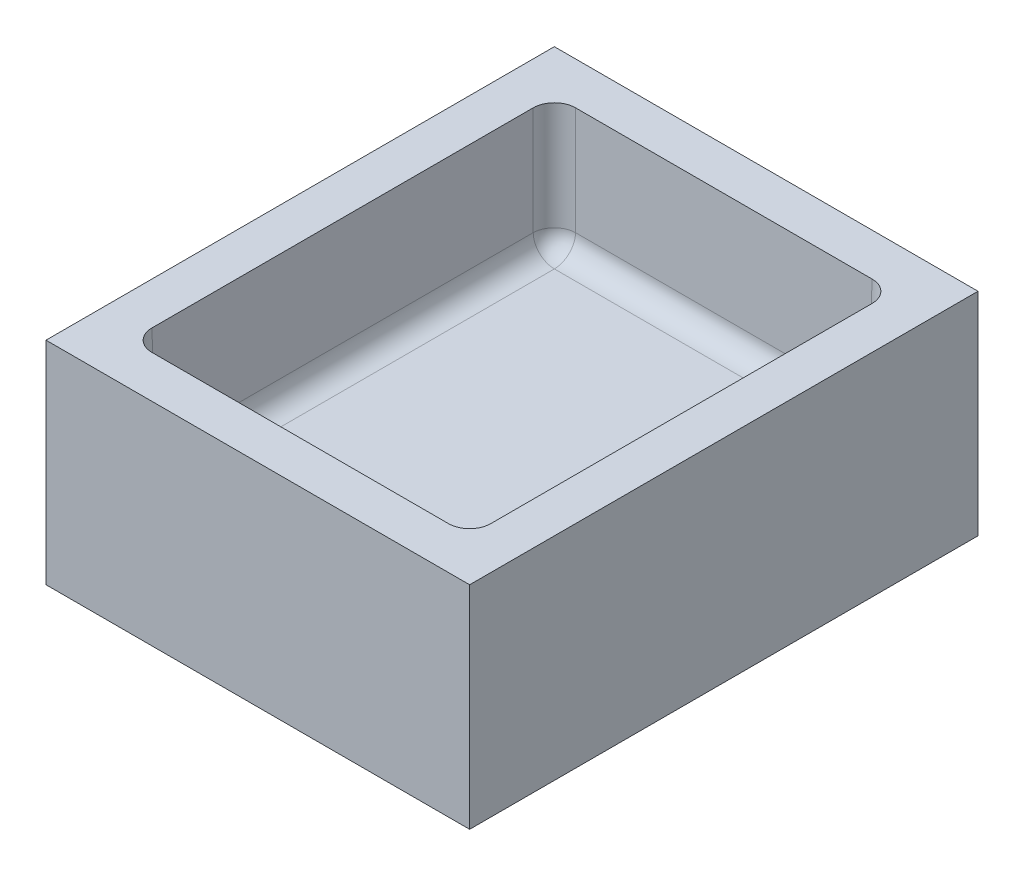
ISO-10303-21;
HEADER;
FILE_DESCRIPTION(('STEP AP214'),'2;1');
FILE_NAME('part.step','',(''),(''),'','','');
FILE_SCHEMA(('AUTOMOTIVE_DESIGN { 1 0 10303 214 1 1 1 1 }'));
ENDSEC;
DATA;
#1=APPLICATION_CONTEXT('core data for automotive mechanical design processes');
#2=APPLICATION_PROTOCOL_DEFINITION('international standard','automotive_design',2000,#1);
#3=PRODUCT_CONTEXT('',#1,'mechanical');
#4=PRODUCT('Part','Part','',(#3));
#5=PRODUCT_RELATED_PRODUCT_CATEGORY('part','',(#4));
#6=PRODUCT_DEFINITION_FORMATION('','',#4);
#7=PRODUCT_DEFINITION_CONTEXT('part definition',#1,'design');
#8=PRODUCT_DEFINITION('design','',#6,#7);
#9=PRODUCT_DEFINITION_SHAPE('','',#8);
#10=(LENGTH_UNIT() NAMED_UNIT(*) SI_UNIT(.MILLI.,.METRE.));
#11=(NAMED_UNIT(*) PLANE_ANGLE_UNIT() SI_UNIT($,.RADIAN.));
#12=(NAMED_UNIT(*) SI_UNIT($,.STERADIAN.) SOLID_ANGLE_UNIT());
#13=UNCERTAINTY_MEASURE_WITH_UNIT(LENGTH_MEASURE(1.E-05),#10,'distance_accuracy_value','');
#14=(GEOMETRIC_REPRESENTATION_CONTEXT(3) GLOBAL_UNCERTAINTY_ASSIGNED_CONTEXT((#13)) GLOBAL_UNIT_ASSIGNED_CONTEXT((#10,
#11,#12)) REPRESENTATION_CONTEXT('',''));
#15=CARTESIAN_POINT('',(0.,0.,0.));
#16=DIRECTION('',(0.,0.,1.));
#17=DIRECTION('',(1.,0.,0.));
#18=AXIS2_PLACEMENT_3D('',#15,#16,#17);
#19=CARTESIAN_POINT('',(-50.,-57.8548057287178,60.));
#20=DIRECTION('',(-1.,0.,0.));
#21=DIRECTION('',(0.,0.,1.));
#22=AXIS2_PLACEMENT_3D('',#19,#20,#21);
#23=PLANE('',#22);
#24=DIRECTION('',(0.,0.,1.));
#25=VECTOR('',#24,1.);
#26=CARTESIAN_POINT('',(-50.,-77.8548057287178,60.));
#27=LINE('',#26,#25);
#28=CARTESIAN_POINT('',(-50.,-77.8548057287178,-60.));
#29=VERTEX_POINT('',#28);
#30=CARTESIAN_POINT('',(-50.,-77.8548057287178,60.));
#31=VERTEX_POINT('',#30);
#32=EDGE_CURVE('E221',#29,#31,#27,.T.);
#33=ORIENTED_EDGE('',*,*,#32,.F.);
#34=DIRECTION('',(0.,-1.,0.));
#35=VECTOR('',#34,1.);
#36=CARTESIAN_POINT('',(-50.,-57.8548057287178,-60.));
#37=LINE('',#36,#35);
#38=CARTESIAN_POINT('',(-50.,-127.854805728718,-60.));
#39=VERTEX_POINT('',#38);
#40=EDGE_CURVE('E236',#29,#39,#37,.T.);
#41=ORIENTED_EDGE('',*,*,#40,.T.);
#42=DIRECTION('',(0.,0.,-1.));
#43=VECTOR('',#42,1.);
#44=CARTESIAN_POINT('',(-50.,-127.854805728718,60.));
#45=LINE('',#44,#43);
#46=CARTESIAN_POINT('',(-50.,-127.854805728718,60.));
#47=VERTEX_POINT('',#46);
#48=EDGE_CURVE('E224',#47,#39,#45,.T.);
#49=ORIENTED_EDGE('',*,*,#48,.F.);
#50=DIRECTION('',(0.,-1.,0.));
#51=VECTOR('',#50,1.);
#52=CARTESIAN_POINT('',(-50.,-57.8548057287178,60.));
#53=LINE('',#52,#51);
#54=EDGE_CURVE('E218',#31,#47,#53,.T.);
#55=ORIENTED_EDGE('',*,*,#54,.F.);
#56=EDGE_LOOP('',(#33,#41,#49,#55));
#57=FACE_BOUND('',#56,.T.);
#58=ADVANCED_FACE('F39',(#57),#23,.T.);
#59=CARTESIAN_POINT('',(-50.,-57.8548057287178,60.));
#60=DIRECTION('',(0.,0.,1.));
#61=DIRECTION('',(1.,0.,0.));
#62=AXIS2_PLACEMENT_3D('',#59,#60,#61);
#63=PLANE('',#62);
#64=DIRECTION('',(1.,0.,0.));
#65=VECTOR('',#64,1.);
#66=CARTESIAN_POINT('',(-50.,-77.8548057287178,60.));
#67=LINE('',#66,#65);
#68=CARTESIAN_POINT('',(50.,-77.8548057287178,60.));
#69=VERTEX_POINT('',#68);
#70=EDGE_CURVE('E217',#31,#69,#67,.T.);
#71=ORIENTED_EDGE('',*,*,#70,.F.);
#72=ORIENTED_EDGE('',*,*,#54,.T.);
#73=DIRECTION('',(-1.,0.,0.));
#74=VECTOR('',#73,1.);
#75=CARTESIAN_POINT('',(-50.,-127.854805728718,60.));
#76=LINE('',#75,#74);
#77=CARTESIAN_POINT('',(50.,-127.854805728718,60.));
#78=VERTEX_POINT('',#77);
#79=EDGE_CURVE('E233',#78,#47,#76,.T.);
#80=ORIENTED_EDGE('',*,*,#79,.F.);
#81=DIRECTION('',(0.,-1.,0.));
#82=VECTOR('',#81,1.);
#83=CARTESIAN_POINT('',(50.,-57.8548057287178,60.));
#84=LINE('',#83,#82);
#85=EDGE_CURVE('E239',#69,#78,#84,.T.);
#86=ORIENTED_EDGE('',*,*,#85,.F.);
#87=EDGE_LOOP('',(#71,#72,#80,#86));
#88=FACE_BOUND('',#87,.T.);
#89=ADVANCED_FACE('F270',(#88),#63,.T.);
#90=CARTESIAN_POINT('',(50.,-57.8548057287178,60.));
#91=DIRECTION('',(1.,0.,0.));
#92=DIRECTION('',(0.,0.,-1.));
#93=AXIS2_PLACEMENT_3D('',#90,#91,#92);
#94=PLANE('',#93);
#95=DIRECTION('',(0.,0.,-1.));
#96=VECTOR('',#95,1.);
#97=CARTESIAN_POINT('',(50.,-77.8548057287178,60.));
#98=LINE('',#97,#96);
#99=CARTESIAN_POINT('',(50.,-77.8548057287178,-60.));
#100=VERTEX_POINT('',#99);
#101=EDGE_CURVE('E214',#69,#100,#98,.T.);
#102=ORIENTED_EDGE('',*,*,#101,.F.);
#103=ORIENTED_EDGE('',*,*,#85,.T.);
#104=DIRECTION('',(0.,0.,1.));
#105=VECTOR('',#104,1.);
#106=CARTESIAN_POINT('',(50.,-127.854805728718,60.));
#107=LINE('',#106,#105);
#108=CARTESIAN_POINT('',(50.,-127.854805728718,-60.));
#109=VERTEX_POINT('',#108);
#110=EDGE_CURVE('E230',#109,#78,#107,.T.);
#111=ORIENTED_EDGE('',*,*,#110,.F.);
#112=DIRECTION('',(0.,-1.,0.));
#113=VECTOR('',#112,1.);
#114=CARTESIAN_POINT('',(50.,-57.8548057287178,-60.));
#115=LINE('',#114,#113);
#116=EDGE_CURVE('E242',#100,#109,#115,.T.);
#117=ORIENTED_EDGE('',*,*,#116,.F.);
#118=EDGE_LOOP('',(#102,#103,#111,#117));
#119=FACE_BOUND('',#118,.T.);
#120=ADVANCED_FACE('F283',(#119),#94,.T.);
#121=CARTESIAN_POINT('',(-50.,-57.8548057287178,-60.));
#122=DIRECTION('',(0.,0.,-1.));
#123=DIRECTION('',(-1.,0.,0.));
#124=AXIS2_PLACEMENT_3D('',#121,#122,#123);
#125=PLANE('',#124);
#126=DIRECTION('',(-1.,0.,0.));
#127=VECTOR('',#126,1.);
#128=CARTESIAN_POINT('',(-50.,-77.8548057287178,-60.));
#129=LINE('',#128,#127);
#130=EDGE_CURVE('E42',#100,#29,#129,.T.);
#131=ORIENTED_EDGE('',*,*,#130,.F.);
#132=ORIENTED_EDGE('',*,*,#116,.T.);
#133=DIRECTION('',(1.,0.,0.));
#134=VECTOR('',#133,1.);
#135=CARTESIAN_POINT('',(-50.,-127.854805728718,-60.));
#136=LINE('',#135,#134);
#137=EDGE_CURVE('E227',#39,#109,#136,.T.);
#138=ORIENTED_EDGE('',*,*,#137,.F.);
#139=ORIENTED_EDGE('',*,*,#40,.F.);
#140=EDGE_LOOP('',(#131,#132,#138,#139));
#141=FACE_BOUND('',#140,.T.);
#142=ADVANCED_FACE('F258',(#141),#125,.T.);
#143=CARTESIAN_POINT('',(0.,-127.854805728718,0.));
#144=DIRECTION('',(0.,-1.,0.));
#145=DIRECTION('',(0.,0.,-1.));
#146=AXIS2_PLACEMENT_3D('',#143,#144,#145);
#147=PLANE('',#146);
#148=ORIENTED_EDGE('',*,*,#48,.T.);
#149=ORIENTED_EDGE('',*,*,#137,.T.);
#150=ORIENTED_EDGE('',*,*,#110,.T.);
#151=ORIENTED_EDGE('',*,*,#79,.T.);
#152=EDGE_LOOP('',(#148,#149,#150,#151));
#153=FACE_BOUND('',#152,.T.);
#154=ADVANCED_FACE('F262',(#153),#147,.T.);
#155=CARTESIAN_POINT('',(0.,-107.854805728718,0.));
#156=DIRECTION('',(0.,-1.,0.));
#157=DIRECTION('',(0.,0.,-1.));
#158=AXIS2_PLACEMENT_3D('',#155,#156,#157);
#159=PLANE('',#158);
#160=DIRECTION('',(1.,0.,0.));
#161=VECTOR('',#160,1.);
#162=CARTESIAN_POINT('',(0.,-107.854805728718,44.562861736575));
#163=LINE('',#162,#161);
#164=CARTESIAN_POINT('',(34.562861736575,-107.854805728718,44.562861736575));
#165=VERTEX_POINT('',#164);
#166=CARTESIAN_POINT('',(-34.562861736575,-107.854805728718,44.562861736575));
#167=VERTEX_POINT('',#166);
#168=EDGE_CURVE('E166',#165,#167,#163,.F.);
#169=ORIENTED_EDGE('',*,*,#168,.F.);
#170=DIRECTION('',(0.,0.,-1.));
#171=VECTOR('',#170,1.);
#172=CARTESIAN_POINT('',(34.562861736575,-107.854805728718,0.));
#173=LINE('',#172,#171);
#174=CARTESIAN_POINT('',(34.562861736575,-107.854805728718,-44.562861736575));
#175=VERTEX_POINT('',#174);
#176=EDGE_CURVE('E154',#175,#165,#173,.F.);
#177=ORIENTED_EDGE('',*,*,#176,.F.);
#178=DIRECTION('',(-1.,0.,0.));
#179=VECTOR('',#178,1.);
#180=CARTESIAN_POINT('',(0.,-107.854805728718,-44.562861736575));
#181=LINE('',#180,#179);
#182=CARTESIAN_POINT('',(-34.5628617365751,-107.854805728718,-44.562861736575));
#183=VERTEX_POINT('',#182);
#184=EDGE_CURVE('E157',#183,#175,#181,.F.);
#185=ORIENTED_EDGE('',*,*,#184,.F.);
#186=DIRECTION('',(0.,0.,1.));
#187=VECTOR('',#186,1.);
#188=CARTESIAN_POINT('',(-34.562861736575,-107.854805728718,0.));
#189=LINE('',#188,#187);
#190=EDGE_CURVE('E169',#167,#183,#189,.F.);
#191=ORIENTED_EDGE('',*,*,#190,.F.);
#192=EDGE_LOOP('',(#169,#177,#185,#191));
#193=FACE_BOUND('',#192,.T.);
#194=ADVANCED_FACE('F324',(#193),#159,.F.);
#195=CARTESIAN_POINT('',(-34.5628617365751,-102.854805728718,-44.562861736575));
#196=DIRECTION('',(0.,-1.,0.));
#197=DIRECTION('',(0.,0.,-1.));
#198=AXIS2_PLACEMENT_3D('',#195,#196,#197);
#199=SPHERICAL_SURFACE('',#198,5.);
#200=CARTESIAN_POINT('',(-34.562861736575,-102.854805728718,-44.562861736575));
#201=DIRECTION('',(0.,0.,-1.));
#202=DIRECTION('',(-1.,0.,0.));
#203=AXIS2_PLACEMENT_3D('',#200,#201,#202);
#204=CIRCLE('',#203,5.);
#205=CARTESIAN_POINT('',(-39.562100212357,-102.942067760904,-44.562861736575));
#206=VERTEX_POINT('',#205);
#207=EDGE_CURVE('E156',#183,#206,#204,.T.);
#208=ORIENTED_EDGE('',*,*,#207,.F.);
#209=CARTESIAN_POINT('',(-34.5628617365751,-102.854805728718,-44.562861736575));
#210=DIRECTION('',(-1.,0.,0.));
#211=DIRECTION('',(0.,0.,1.));
#212=AXIS2_PLACEMENT_3D('',#209,#210,#211);
#213=CIRCLE('',#212,5.);
#214=CARTESIAN_POINT('',(-34.5628617365751,-102.942067760904,-49.562100212357));
#215=VERTEX_POINT('',#214);
#216=EDGE_CURVE('E150',#215,#183,#213,.T.);
#217=ORIENTED_EDGE('',*,*,#216,.F.);
#218=CARTESIAN_POINT('',(-34.5628617365751,-102.854805728718,-44.562861736575));
#219=DIRECTION('',(-0.0174497491606827,0.999695459881887,-0.0174497491606827));
#220=DIRECTION('',(-0.999847695156391,-0.0174524064372836,0.));
#221=AXIS2_PLACEMENT_3D('',#218,#219,#220);
#222=CIRCLE('',#221,5.);
#223=EDGE_CURVE('E175',#215,#206,#222,.T.);
#224=ORIENTED_EDGE('',*,*,#223,.T.);
#225=EDGE_LOOP('',(#208,#217,#224));
#226=FACE_BOUND('',#225,.T.);
#227=ADVANCED_FACE('F334',(#226),#199,.F.);
#228=CARTESIAN_POINT('',(-34.562861736575,-102.854805728718,-50.));
#229=DIRECTION('',(0.,0.,1.));
#230=DIRECTION('',(1.,0.,0.));
#231=AXIS2_PLACEMENT_3D('',#228,#229,#230);
#232=CYLINDRICAL_SURFACE('',#231,5.);
#233=CARTESIAN_POINT('',(-34.562861736575,-102.854805728718,44.562861736575));
#234=DIRECTION('',(0.,0.,-1.));
#235=DIRECTION('',(-1.,0.,0.));
#236=AXIS2_PLACEMENT_3D('',#233,#234,#235);
#237=CIRCLE('',#236,5.);
#238=CARTESIAN_POINT('',(-39.562100212357,-102.942067760904,44.562861736575));
#239=VERTEX_POINT('',#238);
#240=EDGE_CURVE('E170',#167,#239,#237,.T.);
#241=ORIENTED_EDGE('',*,*,#240,.F.);
#242=ORIENTED_EDGE('',*,*,#190,.T.);
#243=ORIENTED_EDGE('',*,*,#207,.T.);
#244=DIRECTION('',(0.,0.,1.));
#245=VECTOR('',#244,1.);
#246=CARTESIAN_POINT('',(-39.562100212357,-102.942067760904,-50.));
#247=LINE('',#246,#245);
#248=EDGE_CURVE('E165',#206,#239,#247,.T.);
#249=ORIENTED_EDGE('',*,*,#248,.T.);
#250=EDGE_LOOP('',(#241,#242,#243,#249));
#251=FACE_BOUND('',#250,.T.);
#252=ADVANCED_FACE('F343',(#251),#232,.F.);
#253=CARTESIAN_POINT('',(-34.562861736575,-102.854805728718,44.562861736575));
#254=DIRECTION('',(0.,-1.,0.));
#255=DIRECTION('',(0.,0.,-1.));
#256=AXIS2_PLACEMENT_3D('',#253,#254,#255);
#257=SPHERICAL_SURFACE('',#256,5.);
#258=CARTESIAN_POINT('',(-34.562861736575,-102.854805728718,44.562861736575));
#259=DIRECTION('',(-1.,0.,0.));
#260=DIRECTION('',(0.,0.,1.));
#261=AXIS2_PLACEMENT_3D('',#258,#259,#260);
#262=CIRCLE('',#261,5.);
#263=CARTESIAN_POINT('',(-34.562861736575,-102.942067760904,49.562100212357));
#264=VERTEX_POINT('',#263);
#265=EDGE_CURVE('E162',#167,#264,#262,.T.);
#266=ORIENTED_EDGE('',*,*,#265,.F.);
#267=ORIENTED_EDGE('',*,*,#240,.T.);
#268=CARTESIAN_POINT('',(-34.562861736575,-102.854805728718,44.562861736575));
#269=DIRECTION('',(-0.0174497491606827,0.999695459881887,0.0174497491606827));
#270=DIRECTION('',(0.,-0.0174524064372835,0.999847695156391));
#271=AXIS2_PLACEMENT_3D('',#268,#269,#270);
#272=CIRCLE('',#271,5.);
#273=EDGE_CURVE('E161',#239,#264,#272,.T.);
#274=ORIENTED_EDGE('',*,*,#273,.T.);
#275=EDGE_LOOP('',(#266,#267,#274));
#276=FACE_BOUND('',#275,.T.);
#277=ADVANCED_FACE('F352',(#276),#257,.F.);
#278=CARTESIAN_POINT('',(40.,-102.854805728718,44.562861736575));
#279=DIRECTION('',(1.,0.,0.));
#280=DIRECTION('',(0.,0.,-1.));
#281=AXIS2_PLACEMENT_3D('',#278,#279,#280);
#282=CYLINDRICAL_SURFACE('',#281,5.);
#283=CARTESIAN_POINT('',(34.562861736575,-102.854805728718,44.562861736575));
#284=DIRECTION('',(-1.,0.,0.));
#285=DIRECTION('',(0.,0.,1.));
#286=AXIS2_PLACEMENT_3D('',#283,#284,#285);
#287=CIRCLE('',#286,5.);
#288=CARTESIAN_POINT('',(34.562861736575,-102.942067760904,49.562100212357));
#289=VERTEX_POINT('',#288);
#290=EDGE_CURVE('E158',#165,#289,#287,.T.);
#291=ORIENTED_EDGE('',*,*,#290,.F.);
#292=ORIENTED_EDGE('',*,*,#168,.T.);
#293=ORIENTED_EDGE('',*,*,#265,.T.);
#294=DIRECTION('',(1.,0.,0.));
#295=VECTOR('',#294,1.);
#296=CARTESIAN_POINT('',(40.,-102.942067760904,49.562100212357));
#297=LINE('',#296,#295);
#298=EDGE_CURVE('E153',#264,#289,#297,.T.);
#299=ORIENTED_EDGE('',*,*,#298,.T.);
#300=EDGE_LOOP('',(#291,#292,#293,#299));
#301=FACE_BOUND('',#300,.T.);
#302=ADVANCED_FACE('F361',(#301),#282,.F.);
#303=CARTESIAN_POINT('',(34.562861736575,-102.854805728718,44.562861736575));
#304=DIRECTION('',(0.,-1.,0.));
#305=DIRECTION('',(0.,0.,-1.));
#306=AXIS2_PLACEMENT_3D('',#303,#304,#305);
#307=SPHERICAL_SURFACE('',#306,5.);
#308=CARTESIAN_POINT('',(34.562861736575,-102.854805728718,44.562861736575));
#309=DIRECTION('',(0.,0.,-1.));
#310=DIRECTION('',(-1.,0.,0.));
#311=AXIS2_PLACEMENT_3D('',#308,#309,#310);
#312=CIRCLE('',#311,5.);
#313=CARTESIAN_POINT('',(39.562100212357,-102.942067760904,44.562861736575));
#314=VERTEX_POINT('',#313);
#315=EDGE_CURVE('E140',#314,#165,#312,.T.);
#316=ORIENTED_EDGE('',*,*,#315,.T.);
#317=ORIENTED_EDGE('',*,*,#290,.T.);
#318=CARTESIAN_POINT('',(34.562861736575,-102.854805728718,44.562861736575));
#319=DIRECTION('',(0.0174497491606827,0.999695459881887,0.0174497491606827));
#320=DIRECTION('',(-0.999847695156391,0.0174524064372836,0.));
#321=AXIS2_PLACEMENT_3D('',#318,#319,#320);
#322=CIRCLE('',#321,5.);
#323=EDGE_CURVE('E145',#289,#314,#322,.T.);
#324=ORIENTED_EDGE('',*,*,#323,.T.);
#325=EDGE_LOOP('',(#316,#317,#324));
#326=FACE_BOUND('',#325,.T.);
#327=ADVANCED_FACE('F370',(#326),#307,.F.);
#328=CARTESIAN_POINT('',(34.562861736575,-102.854805728718,-50.));
#329=DIRECTION('',(0.,0.,-1.));
#330=DIRECTION('',(-1.,0.,0.));
#331=AXIS2_PLACEMENT_3D('',#328,#329,#330);
#332=CYLINDRICAL_SURFACE('',#331,5.);
#333=ORIENTED_EDGE('',*,*,#315,.F.);
#334=DIRECTION('',(0.,0.,-1.));
#335=VECTOR('',#334,1.);
#336=CARTESIAN_POINT('',(39.5621002123569,-102.942067760904,-50.));
#337=LINE('',#336,#335);
#338=CARTESIAN_POINT('',(39.562100212357,-102.942067760904,-44.562861736575));
#339=VERTEX_POINT('',#338);
#340=EDGE_CURVE('E121',#314,#339,#337,.T.);
#341=ORIENTED_EDGE('',*,*,#340,.T.);
#342=CARTESIAN_POINT('',(34.562861736575,-102.854805728718,-44.562861736575));
#343=DIRECTION('',(0.,0.,-1.));
#344=DIRECTION('',(-1.,0.,0.));
#345=AXIS2_PLACEMENT_3D('',#342,#343,#344);
#346=CIRCLE('',#345,5.);
#347=EDGE_CURVE('E138',#339,#175,#346,.T.);
#348=ORIENTED_EDGE('',*,*,#347,.T.);
#349=ORIENTED_EDGE('',*,*,#176,.T.);
#350=EDGE_LOOP('',(#333,#341,#348,#349));
#351=FACE_BOUND('',#350,.T.);
#352=ADVANCED_FACE('F136',(#351),#332,.F.);
#353=CARTESIAN_POINT('',(34.562861736575,-102.854805728718,-44.562861736575));
#354=DIRECTION('',(0.,-1.,0.));
#355=DIRECTION('',(0.,0.,-1.));
#356=AXIS2_PLACEMENT_3D('',#353,#354,#355);
#357=SPHERICAL_SURFACE('',#356,5.);
#358=CARTESIAN_POINT('',(34.562861736575,-102.854805728718,-44.562861736575));
#359=DIRECTION('',(0.0174497491606827,0.999695459881887,-0.0174497491606827));
#360=DIRECTION('',(0.,0.0174524064372835,0.999847695156391));
#361=AXIS2_PLACEMENT_3D('',#358,#359,#360);
#362=CIRCLE('',#361,5.);
#363=CARTESIAN_POINT('',(34.562861736575,-102.942067760904,-49.562100212357));
#364=VERTEX_POINT('',#363);
#365=EDGE_CURVE('E115',#339,#364,#362,.T.);
#366=ORIENTED_EDGE('',*,*,#365,.T.);
#367=CARTESIAN_POINT('',(34.562861736575,-102.854805728718,-44.562861736575));
#368=DIRECTION('',(-1.,0.,0.));
#369=DIRECTION('',(0.,0.,1.));
#370=AXIS2_PLACEMENT_3D('',#367,#368,#369);
#371=CIRCLE('',#370,5.);
#372=EDGE_CURVE('E131',#364,#175,#371,.T.);
#373=ORIENTED_EDGE('',*,*,#372,.T.);
#374=ORIENTED_EDGE('',*,*,#347,.F.);
#375=EDGE_LOOP('',(#366,#373,#374));
#376=FACE_BOUND('',#375,.T.);
#377=ADVANCED_FACE('F142',(#376),#357,.F.);
#378=CARTESIAN_POINT('',(40.,-102.854805728718,-44.562861736575));
#379=DIRECTION('',(-1.,0.,0.));
#380=DIRECTION('',(0.,0.,1.));
#381=AXIS2_PLACEMENT_3D('',#378,#379,#380);
#382=CYLINDRICAL_SURFACE('',#381,5.);
#383=ORIENTED_EDGE('',*,*,#372,.F.);
#384=DIRECTION('',(-1.,0.,0.));
#385=VECTOR('',#384,1.);
#386=CARTESIAN_POINT('',(40.,-102.942067760904,-49.562100212357));
#387=LINE('',#386,#385);
#388=EDGE_CURVE('E207',#364,#215,#387,.T.);
#389=ORIENTED_EDGE('',*,*,#388,.T.);
#390=ORIENTED_EDGE('',*,*,#216,.T.);
#391=ORIENTED_EDGE('',*,*,#184,.T.);
#392=EDGE_LOOP('',(#383,#389,#390,#391));
#393=FACE_BOUND('',#392,.T.);
#394=ADVANCED_FACE('F394',(#393),#382,.F.);
#395=CARTESIAN_POINT('',(40.,-77.8548057287178,-50.));
#396=DIRECTION('',(0.,-0.0174524064372835,-0.999847695156391));
#397=DIRECTION('',(0.,0.999847695156391,-0.0174524064372835));
#398=AXIS2_PLACEMENT_3D('',#395,#396,#397);
#399=PLANE('',#398);
#400=DIRECTION('',(0.0174497491606827,0.999695459881888,-0.0174497491606827));
#401=VECTOR('',#400,1.);
#402=CARTESIAN_POINT('',(35.0022837610675,-77.7675968380175,-50.0015222368495));
#403=LINE('',#402,#401);
#404=CARTESIAN_POINT('',(35.000761524218,-77.8548057287178,-50.));
#405=VERTEX_POINT('',#404);
#406=EDGE_CURVE('E129',#405,#364,#403,.F.);
#407=ORIENTED_EDGE('',*,*,#406,.F.);
#408=DIRECTION('',(-1.,0.,0.));
#409=VECTOR('',#408,1.);
#410=CARTESIAN_POINT('',(40.,-77.8548057287178,-50.));
#411=LINE('',#410,#409);
#412=CARTESIAN_POINT('',(-35.0007615242181,-77.8548057287178,-50.));
#413=VERTEX_POINT('',#412);
#414=EDGE_CURVE('E178',#405,#413,#411,.T.);
#415=ORIENTED_EDGE('',*,*,#414,.T.);
#416=DIRECTION('',(-0.0174497491606827,0.999695459881888,-0.0174497491606827));
#417=VECTOR('',#416,1.);
#418=CARTESIAN_POINT('',(-34.9779242614059,-79.1631516389784,-49.9771627371879));
#419=LINE('',#418,#417);
#420=EDGE_CURVE('E182',#215,#413,#419,.T.);
#421=ORIENTED_EDGE('',*,*,#420,.F.);
#422=ORIENTED_EDGE('',*,*,#388,.F.);
#423=EDGE_LOOP('',(#407,#415,#421,#422));
#424=FACE_BOUND('',#423,.T.);
#425=ADVANCED_FACE('F402',(#424),#399,.F.);
#426=CARTESIAN_POINT('',(-34.9779242614059,-79.075889606792,-44.9779242614059));
#427=DIRECTION('',(-0.0174497491606827,0.999695459881887,-0.0174497491606827));
#428=DIRECTION('',(-0.999847695156391,-0.0174524064372836,0.));
#429=AXIS2_PLACEMENT_3D('',#426,#427,#428);
#430=CYLINDRICAL_SURFACE('',#429,5.);
#431=ORIENTED_EDGE('',*,*,#420,.T.);
#432=CARTESIAN_POINT('',(-34.9992383597805,-77.8548057287178,-44.9992383597805));
#433=DIRECTION('',(0.,-1.,0.));
#434=DIRECTION('',(-0.707106781186548,0.,-0.707106781186547));
#435=AXIS2_PLACEMENT_3D('',#432,#433,#434);
#436=ELLIPSE('',#435,5.00152316445525,5.);
#437=CARTESIAN_POINT('',(-40.,-77.8548057287178,-45.0007615242181));
#438=VERTEX_POINT('',#437);
#439=EDGE_CURVE('E186',#413,#438,#436,.F.);
#440=ORIENTED_EDGE('',*,*,#439,.T.);
#441=DIRECTION('',(-0.0174497491606827,0.999695459881888,-0.0174497491606827));
#442=VECTOR('',#441,1.);
#443=CARTESIAN_POINT('',(-40.0015222368495,-77.7675968380175,-45.0022837610676));
#444=LINE('',#443,#442);
#445=EDGE_CURVE('E181',#438,#206,#444,.F.);
#446=ORIENTED_EDGE('',*,*,#445,.T.);
#447=ORIENTED_EDGE('',*,*,#223,.F.);
#448=EDGE_LOOP('',(#431,#440,#446,#447));
#449=FACE_BOUND('',#448,.T.);
#450=ADVANCED_FACE('F411',(#449),#430,.F.);
#451=CARTESIAN_POINT('',(-40.,-77.8548057287178,-50.));
#452=DIRECTION('',(-0.999847695156391,-0.0174524064372835,0.));
#453=DIRECTION('',(0.0174524064372835,-0.999847695156391,0.));
#454=AXIS2_PLACEMENT_3D('',#451,#452,#453);
#455=PLANE('',#454);
#456=ORIENTED_EDGE('',*,*,#445,.F.);
#457=DIRECTION('',(0.,0.,1.));
#458=VECTOR('',#457,1.);
#459=CARTESIAN_POINT('',(-40.,-77.8548057287178,-50.));
#460=LINE('',#459,#458);
#461=CARTESIAN_POINT('',(-40.,-77.8548057287178,45.000761524218));
#462=VERTEX_POINT('',#461);
#463=EDGE_CURVE('E187',#438,#462,#460,.T.);
#464=ORIENTED_EDGE('',*,*,#463,.T.);
#465=DIRECTION('',(-0.0174497491606827,0.999695459881888,0.0174497491606827));
#466=VECTOR('',#465,1.);
#467=CARTESIAN_POINT('',(-39.9710728622724,-79.5120403392187,44.9718343864904));
#468=LINE('',#467,#466);
#469=EDGE_CURVE('E191',#239,#462,#468,.T.);
#470=ORIENTED_EDGE('',*,*,#469,.F.);
#471=ORIENTED_EDGE('',*,*,#248,.F.);
#472=EDGE_LOOP('',(#456,#464,#470,#471));
#473=FACE_BOUND('',#472,.T.);
#474=ADVANCED_FACE('F420',(#473),#455,.F.);
#475=CARTESIAN_POINT('',(-34.9718343864905,-79.4247783070323,44.9718343864904));
#476=DIRECTION('',(-0.0174497491606827,0.999695459881887,0.0174497491606827));
#477=DIRECTION('',(0.,-0.0174524064372835,0.999847695156391));
#478=AXIS2_PLACEMENT_3D('',#475,#476,#477);
#479=CYLINDRICAL_SURFACE('',#478,5.);
#480=ORIENTED_EDGE('',*,*,#469,.T.);
#481=CARTESIAN_POINT('',(-34.9992383597805,-77.8548057287178,44.9992383597804));
#482=DIRECTION('',(0.,-1.,0.));
#483=DIRECTION('',(-0.707106781186547,0.,0.707106781186548));
#484=AXIS2_PLACEMENT_3D('',#481,#482,#483);
#485=ELLIPSE('',#484,5.00152316445525,5.);
#486=CARTESIAN_POINT('',(-35.0007615242181,-77.8548057287178,50.));
#487=VERTEX_POINT('',#486);
#488=EDGE_CURVE('E195',#462,#487,#485,.F.);
#489=ORIENTED_EDGE('',*,*,#488,.T.);
#490=DIRECTION('',(-0.0174497491606827,0.999695459881888,0.0174497491606827));
#491=VECTOR('',#490,1.);
#492=CARTESIAN_POINT('',(-34.9779242614059,-79.1631516389784,49.9771627371878));
#493=LINE('',#492,#491);
#494=EDGE_CURVE('E190',#487,#264,#493,.F.);
#495=ORIENTED_EDGE('',*,*,#494,.T.);
#496=ORIENTED_EDGE('',*,*,#273,.F.);
#497=EDGE_LOOP('',(#480,#489,#495,#496));
#498=FACE_BOUND('',#497,.T.);
#499=ADVANCED_FACE('F429',(#498),#479,.F.);
#500=CARTESIAN_POINT('',(40.,-77.8548057287178,50.));
#501=DIRECTION('',(0.,-0.0174524064372835,0.999847695156391));
#502=DIRECTION('',(0.,-0.999847695156391,-0.0174524064372835));
#503=AXIS2_PLACEMENT_3D('',#500,#501,#502);
#504=PLANE('',#503);
#505=ORIENTED_EDGE('',*,*,#494,.F.);
#506=DIRECTION('',(1.,0.,0.));
#507=VECTOR('',#506,1.);
#508=CARTESIAN_POINT('',(40.,-77.8548057287178,50.));
#509=LINE('',#508,#507);
#510=CARTESIAN_POINT('',(35.000761524218,-77.8548057287178,50.));
#511=VERTEX_POINT('',#510);
#512=EDGE_CURVE('E196',#487,#511,#509,.T.);
#513=ORIENTED_EDGE('',*,*,#512,.T.);
#514=DIRECTION('',(0.0174497491606827,0.999695459881888,0.0174497491606827));
#515=VECTOR('',#514,1.);
#516=CARTESIAN_POINT('',(35.0022837610675,-77.7675968380175,50.0015222368495));
#517=LINE('',#516,#515);
#518=EDGE_CURVE('E200',#289,#511,#517,.T.);
#519=ORIENTED_EDGE('',*,*,#518,.F.);
#520=ORIENTED_EDGE('',*,*,#298,.F.);
#521=EDGE_LOOP('',(#505,#513,#519,#520));
#522=FACE_BOUND('',#521,.T.);
#523=ADVANCED_FACE('F438',(#522),#504,.F.);
#524=CARTESIAN_POINT('',(35.0022837610675,-77.680334805831,45.0022837610675));
#525=DIRECTION('',(0.0174497491606827,0.999695459881887,0.0174497491606827));
#526=DIRECTION('',(-0.999847695156391,0.0174524064372836,0.));
#527=AXIS2_PLACEMENT_3D('',#524,#525,#526);
#528=CYLINDRICAL_SURFACE('',#527,5.);
#529=ORIENTED_EDGE('',*,*,#518,.T.);
#530=CARTESIAN_POINT('',(34.9992383597804,-77.8548057287178,44.9992383597804));
#531=DIRECTION('',(0.,-1.,0.));
#532=DIRECTION('',(0.707106781186548,0.,0.707106781186547));
#533=AXIS2_PLACEMENT_3D('',#530,#531,#532);
#534=ELLIPSE('',#533,5.00152316445525,5.);
#535=CARTESIAN_POINT('',(40.,-77.8548057287178,45.000761524218));
#536=VERTEX_POINT('',#535);
#537=EDGE_CURVE('E125',#511,#536,#534,.F.);
#538=ORIENTED_EDGE('',*,*,#537,.T.);
#539=DIRECTION('',(0.0174497491606827,0.999695459881888,0.0174497491606827));
#540=VECTOR('',#539,1.);
#541=CARTESIAN_POINT('',(39.9710728622724,-79.5120403392187,44.9718343864904));
#542=LINE('',#541,#540);
#543=EDGE_CURVE('E199',#536,#314,#542,.F.);
#544=ORIENTED_EDGE('',*,*,#543,.T.);
#545=ORIENTED_EDGE('',*,*,#323,.F.);
#546=EDGE_LOOP('',(#529,#538,#544,#545));
#547=FACE_BOUND('',#546,.T.);
#548=ADVANCED_FACE('F299',(#547),#528,.F.);
#549=CARTESIAN_POINT('',(40.,-77.8548057287178,-50.));
#550=DIRECTION('',(0.999847695156391,-0.0174524064372835,0.));
#551=DIRECTION('',(0.0174524064372835,0.999847695156391,0.));
#552=AXIS2_PLACEMENT_3D('',#549,#550,#551);
#553=PLANE('',#552);
#554=ORIENTED_EDGE('',*,*,#543,.F.);
#555=DIRECTION('',(0.,0.,-1.));
#556=VECTOR('',#555,1.);
#557=CARTESIAN_POINT('',(40.,-77.8548057287178,-50.));
#558=LINE('',#557,#556);
#559=CARTESIAN_POINT('',(40.,-77.8548057287178,-45.0007615242181));
#560=VERTEX_POINT('',#559);
#561=EDGE_CURVE('E49',#536,#560,#558,.T.);
#562=ORIENTED_EDGE('',*,*,#561,.T.);
#563=DIRECTION('',(0.0174497491606827,0.999695459881888,-0.0174497491606827));
#564=VECTOR('',#563,1.);
#565=CARTESIAN_POINT('',(40.0015222368495,-77.7675968380175,-45.0022837610676));
#566=LINE('',#565,#564);
#567=EDGE_CURVE('E118',#339,#560,#566,.T.);
#568=ORIENTED_EDGE('',*,*,#567,.F.);
#569=ORIENTED_EDGE('',*,*,#340,.F.);
#570=EDGE_LOOP('',(#554,#562,#568,#569));
#571=FACE_BOUND('',#570,.T.);
#572=ADVANCED_FACE('F119',(#571),#553,.F.);
#573=CARTESIAN_POINT('',(35.0022837610675,-77.680334805831,-45.0022837610676));
#574=DIRECTION('',(0.0174497491606827,0.999695459881887,-0.0174497491606827));
#575=DIRECTION('',(0.,0.0174524064372835,0.999847695156391));
#576=AXIS2_PLACEMENT_3D('',#573,#574,#575);
#577=CYLINDRICAL_SURFACE('',#576,5.);
#578=ORIENTED_EDGE('',*,*,#567,.T.);
#579=CARTESIAN_POINT('',(34.9992383597804,-77.8548057287178,-44.9992383597805));
#580=DIRECTION('',(0.,-1.,0.));
#581=DIRECTION('',(0.707106781186547,0.,-0.707106781186548));
#582=AXIS2_PLACEMENT_3D('',#579,#580,#581);
#583=ELLIPSE('',#582,5.00152316445525,5.);
#584=EDGE_CURVE('E11',#560,#405,#583,.F.);
#585=ORIENTED_EDGE('',*,*,#584,.T.);
#586=ORIENTED_EDGE('',*,*,#406,.T.);
#587=ORIENTED_EDGE('',*,*,#365,.F.);
#588=EDGE_LOOP('',(#578,#585,#586,#587));
#589=FACE_BOUND('',#588,.T.);
#590=ADVANCED_FACE('F127',(#589),#577,.F.);
#591=CARTESIAN_POINT('',(-35.000761524218,-77.8548057287178,50.));
#592=DIRECTION('',(0.,-1.,0.));
#593=DIRECTION('',(1.,0.,0.));
#594=AXIS2_PLACEMENT_3D('',#591,#592,#593);
#595=PLANE('',#594);
#596=ORIENTED_EDGE('',*,*,#32,.T.);
#597=ORIENTED_EDGE('',*,*,#70,.T.);
#598=ORIENTED_EDGE('',*,*,#101,.T.);
#599=ORIENTED_EDGE('',*,*,#130,.T.);
#600=EDGE_LOOP('',(#596,#597,#598,#599));
#601=FACE_BOUND('',#600,.T.);
#602=ORIENTED_EDGE('',*,*,#414,.F.);
#603=ORIENTED_EDGE('',*,*,#584,.F.);
#604=ORIENTED_EDGE('',*,*,#561,.F.);
#605=ORIENTED_EDGE('',*,*,#537,.F.);
#606=ORIENTED_EDGE('',*,*,#512,.F.);
#607=ORIENTED_EDGE('',*,*,#488,.F.);
#608=ORIENTED_EDGE('',*,*,#463,.F.);
#609=ORIENTED_EDGE('',*,*,#439,.F.);
#610=EDGE_LOOP('',(#602,#603,#604,#605,#606,#607,#608,#609));
#611=FACE_BOUND('',#610,.T.);
#612=ADVANCED_FACE('F281',(#601,#611),#595,.F.);
#613=CLOSED_SHELL('',(#58,#89,#120,#142,#154,#194,#227,#252,#277,#302,#327,#352,#377,#394,#425,
#450,#474,#499,#523,#548,#572,#590,#612));
#614=MANIFOLD_SOLID_BREP('B2',#613);
#615=ADVANCED_BREP_SHAPE_REPRESENTATION('',(#18,#614),#14);
#616=SHAPE_DEFINITION_REPRESENTATION(#9,#615);
ENDSEC;
END-ISO-10303-21;
